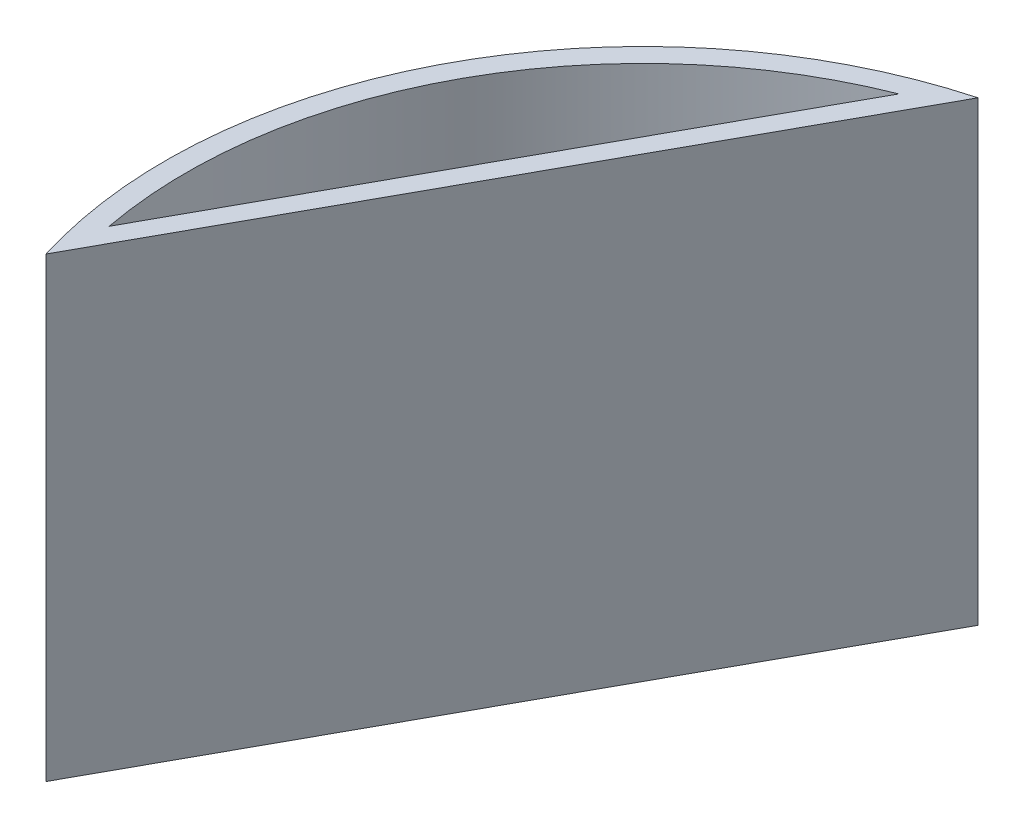
ISO-10303-21;
HEADER;
FILE_DESCRIPTION(('STEP AP214'),'2;1');
FILE_NAME('part.step','',(''),(''),'','','');
FILE_SCHEMA(('AUTOMOTIVE_DESIGN { 1 0 10303 214 1 1 1 1 }'));
ENDSEC;
DATA;
#1=APPLICATION_CONTEXT('core data for automotive mechanical design processes');
#2=APPLICATION_PROTOCOL_DEFINITION('international standard','automotive_design',2000,#1);
#3=PRODUCT_CONTEXT('',#1,'mechanical');
#4=PRODUCT('Part','Part','',(#3));
#5=PRODUCT_RELATED_PRODUCT_CATEGORY('part','',(#4));
#6=PRODUCT_DEFINITION_FORMATION('','',#4);
#7=PRODUCT_DEFINITION_CONTEXT('part definition',#1,'design');
#8=PRODUCT_DEFINITION('design','',#6,#7);
#9=PRODUCT_DEFINITION_SHAPE('','',#8);
#10=(LENGTH_UNIT() NAMED_UNIT(*) SI_UNIT(.MILLI.,.METRE.));
#11=(NAMED_UNIT(*) PLANE_ANGLE_UNIT() SI_UNIT($,.RADIAN.));
#12=(NAMED_UNIT(*) SI_UNIT($,.STERADIAN.) SOLID_ANGLE_UNIT());
#13=UNCERTAINTY_MEASURE_WITH_UNIT(LENGTH_MEASURE(1.E-05),#10,'distance_accuracy_value','');
#14=(GEOMETRIC_REPRESENTATION_CONTEXT(3) GLOBAL_UNCERTAINTY_ASSIGNED_CONTEXT((#13)) GLOBAL_UNIT_ASSIGNED_CONTEXT((#10,
#11,#12)) REPRESENTATION_CONTEXT('',''));
#15=CARTESIAN_POINT('',(0.,0.,0.));
#16=DIRECTION('',(0.,0.,1.));
#17=DIRECTION('',(1.,0.,0.));
#18=AXIS2_PLACEMENT_3D('',#15,#16,#17);
#19=CARTESIAN_POINT('',(0.,63.5,0.));
#20=DIRECTION('',(0.,1.,0.));
#21=DIRECTION('',(0.,0.,1.));
#22=AXIS2_PLACEMENT_3D('',#19,#20,#21);
#23=PLANE('',#22);
#24=DIRECTION('',(0.48190085223737,0.,-0.876225752082702));
#25=VECTOR('',#24,1.);
#26=CARTESIAN_POINT('',(-67.6152931744622,63.5,17.5269686178623));
#27=LINE('',#26,#25);
#28=CARTESIAN_POINT('',(-69.7925987140124,63.5,21.4858974619361));
#29=VERTEX_POINT('',#28);
#30=CARTESIAN_POINT('',(-19.2319376975901,63.5,-70.4470240492529));
#31=VERTEX_POINT('',#30);
#32=EDGE_CURVE('E80',#29,#31,#27,.T.);
#33=ORIENTED_EDGE('',*,*,#32,.T.);
#34=CARTESIAN_POINT('',(0.,63.5,0.));
#35=DIRECTION('',(0.,1.,0.));
#36=DIRECTION('',(0.,0.,1.));
#37=AXIS2_PLACEMENT_3D('',#34,#35,#36);
#38=CIRCLE('',#37,73.025);
#39=EDGE_CURVE('E49',#31,#29,#38,.T.);
#40=ORIENTED_EDGE('',*,*,#39,.T.);
#41=EDGE_LOOP('',(#33,#40));
#42=FACE_BOUND('',#41,.T.);
#43=DIRECTION('',(0.48190085223737,0.,-0.876225752082702));
#44=VECTOR('',#43,1.);
#45=CARTESIAN_POINT('',(-25.7918971595235,63.5,-64.9137931483946));
#46=LINE('',#45,#44);
#47=CARTESIAN_POINT('',(-68.6328829234257,63.5,12.9826762117576));
#48=VERTEX_POINT('',#47);
#49=CARTESIAN_POINT('',(-25.7918971595235,63.5,-64.9137931483946));
#50=VERTEX_POINT('',#49);
#51=EDGE_CURVE('E99',#48,#50,#46,.T.);
#52=ORIENTED_EDGE('',*,*,#51,.F.);
#53=CARTESIAN_POINT('',(0.,63.5,0.));
#54=DIRECTION('',(0.,1.,0.));
#55=DIRECTION('',(0.,0.,1.));
#56=AXIS2_PLACEMENT_3D('',#53,#54,#55);
#57=CIRCLE('',#56,69.85);
#58=EDGE_CURVE('E101',#50,#48,#57,.T.);
#59=ORIENTED_EDGE('',*,*,#58,.F.);
#60=EDGE_LOOP('',(#52,#59));
#61=FACE_BOUND('',#60,.T.);
#62=ADVANCED_FACE('F41',(#42,#61),#23,.T.);
#63=CARTESIAN_POINT('',(0.,63.5,0.));
#64=DIRECTION('',(0.,-1.,0.));
#65=DIRECTION('',(0.,0.,-1.));
#66=AXIS2_PLACEMENT_3D('',#63,#64,#65);
#67=CYLINDRICAL_SURFACE('',#66,73.025);
#68=ORIENTED_EDGE('',*,*,#39,.F.);
#69=DIRECTION('',(0.,-1.,0.));
#70=VECTOR('',#69,1.);
#71=CARTESIAN_POINT('',(-19.2319376975901,63.5,-70.4470240492529));
#72=LINE('',#71,#70);
#73=CARTESIAN_POINT('',(-19.2319376975901,-6.35,-70.4470240492529));
#74=VERTEX_POINT('',#73);
#75=EDGE_CURVE('E87',#31,#74,#72,.T.);
#76=ORIENTED_EDGE('',*,*,#75,.T.);
#77=CARTESIAN_POINT('',(0.,-6.35,0.));
#78=DIRECTION('',(0.,-1.,0.));
#79=DIRECTION('',(0.,0.,-1.));
#80=AXIS2_PLACEMENT_3D('',#77,#78,#79);
#81=CIRCLE('',#80,73.025);
#82=CARTESIAN_POINT('',(-69.7925987140124,-6.35,21.485897461936));
#83=VERTEX_POINT('',#82);
#84=EDGE_CURVE('E84',#83,#74,#81,.T.);
#85=ORIENTED_EDGE('',*,*,#84,.F.);
#86=DIRECTION('',(0.,-1.,0.));
#87=VECTOR('',#86,1.);
#88=CARTESIAN_POINT('',(-69.7925987140124,63.5,21.485897461936));
#89=LINE('',#88,#87);
#90=EDGE_CURVE('E55',#83,#29,#89,.F.);
#91=ORIENTED_EDGE('',*,*,#90,.T.);
#92=EDGE_LOOP('',(#68,#76,#85,#91));
#93=FACE_BOUND('',#92,.T.);
#94=ADVANCED_FACE('F43',(#93),#67,.T.);
#95=CARTESIAN_POINT('',(0.,-6.35,0.));
#96=DIRECTION('',(0.,-1.,0.));
#97=DIRECTION('',(0.,0.,-1.));
#98=AXIS2_PLACEMENT_3D('',#95,#96,#97);
#99=PLANE('',#98);
#100=DIRECTION('',(0.48190085223737,0.,-0.876225752082702));
#101=VECTOR('',#100,1.);
#102=CARTESIAN_POINT('',(-44.5122682058013,-6.35,-24.4805632936584));
#103=LINE('',#102,#101);
#104=EDGE_CURVE('E11',#83,#74,#103,.T.);
#105=ORIENTED_EDGE('',*,*,#104,.F.);
#106=ORIENTED_EDGE('',*,*,#84,.T.);
#107=EDGE_LOOP('',(#105,#106));
#108=FACE_BOUND('',#107,.T.);
#109=ADVANCED_FACE('F121',(#108),#99,.T.);
#110=CARTESIAN_POINT('',(-67.6152931744622,63.5,17.5269686178623));
#111=DIRECTION('',(-0.876225752082702,0.,-0.48190085223737));
#112=DIRECTION('',(-0.48190085223737,0.,0.876225752082702));
#113=AXIS2_PLACEMENT_3D('',#110,#111,#112);
#114=PLANE('',#113);
#115=ORIENTED_EDGE('',*,*,#32,.F.);
#116=ORIENTED_EDGE('',*,*,#90,.F.);
#117=ORIENTED_EDGE('',*,*,#104,.T.);
#118=ORIENTED_EDGE('',*,*,#75,.F.);
#119=EDGE_LOOP('',(#115,#116,#117,#118));
#120=FACE_BOUND('',#119,.T.);
#121=ADVANCED_FACE('F88',(#120),#114,.F.);
#122=CARTESIAN_POINT('',(0.,63.5,0.));
#123=DIRECTION('',(0.,-1.,0.));
#124=DIRECTION('',(0.,0.,-1.));
#125=AXIS2_PLACEMENT_3D('',#122,#123,#124);
#126=CYLINDRICAL_SURFACE('',#125,69.85);
#127=DIRECTION('',(0.,-1.,0.));
#128=VECTOR('',#127,1.);
#129=CARTESIAN_POINT('',(-25.7918971595235,63.5,-64.9137931483946));
#130=LINE('',#129,#128);
#131=CARTESIAN_POINT('',(-25.7918971595235,0.,-64.9137931483946));
#132=VERTEX_POINT('',#131);
#133=EDGE_CURVE('E97',#50,#132,#130,.T.);
#134=ORIENTED_EDGE('',*,*,#133,.F.);
#135=ORIENTED_EDGE('',*,*,#58,.T.);
#136=DIRECTION('',(0.,-1.,0.));
#137=VECTOR('',#136,1.);
#138=CARTESIAN_POINT('',(-68.6328829234257,63.5,12.9826762117576));
#139=LINE('',#138,#137);
#140=CARTESIAN_POINT('',(-68.6328829234257,0.,12.9826762117576));
#141=VERTEX_POINT('',#140);
#142=EDGE_CURVE('E63',#48,#141,#139,.T.);
#143=ORIENTED_EDGE('',*,*,#142,.T.);
#144=CARTESIAN_POINT('',(0.,0.,0.));
#145=DIRECTION('',(0.,1.,0.));
#146=DIRECTION('',(0.,0.,1.));
#147=AXIS2_PLACEMENT_3D('',#144,#145,#146);
#148=CIRCLE('',#147,69.85);
#149=EDGE_CURVE('E92',#132,#141,#148,.T.);
#150=ORIENTED_EDGE('',*,*,#149,.F.);
#151=EDGE_LOOP('',(#134,#135,#143,#150));
#152=FACE_BOUND('',#151,.T.);
#153=ADVANCED_FACE('F116',(#152),#126,.F.);
#154=CARTESIAN_POINT('',(-25.7918971595235,63.5,-64.9137931483946));
#155=DIRECTION('',(-0.876225752082702,0.,-0.48190085223737));
#156=DIRECTION('',(-0.48190085223737,0.,0.876225752082702));
#157=AXIS2_PLACEMENT_3D('',#154,#155,#156);
#158=PLANE('',#157);
#159=ORIENTED_EDGE('',*,*,#142,.F.);
#160=ORIENTED_EDGE('',*,*,#51,.T.);
#161=ORIENTED_EDGE('',*,*,#133,.T.);
#162=DIRECTION('',(0.48190085223737,0.,-0.876225752082702));
#163=VECTOR('',#162,1.);
#164=CARTESIAN_POINT('',(-25.7918971595235,0.,-64.9137931483946));
#165=LINE('',#164,#163);
#166=EDGE_CURVE('E103',#141,#132,#165,.T.);
#167=ORIENTED_EDGE('',*,*,#166,.F.);
#168=EDGE_LOOP('',(#159,#160,#161,#167));
#169=FACE_BOUND('',#168,.T.);
#170=ADVANCED_FACE('F113',(#169),#158,.T.);
#171=CARTESIAN_POINT('',(0.,0.,0.));
#172=DIRECTION('',(0.,1.,0.));
#173=DIRECTION('',(0.,0.,1.));
#174=AXIS2_PLACEMENT_3D('',#171,#172,#173);
#175=PLANE('',#174);
#176=ORIENTED_EDGE('',*,*,#149,.T.);
#177=ORIENTED_EDGE('',*,*,#166,.T.);
#178=EDGE_LOOP('',(#176,#177));
#179=FACE_BOUND('',#178,.T.);
#180=ADVANCED_FACE('F110',(#179),#175,.T.);
#181=CLOSED_SHELL('',(#62,#94,#109,#121,#153,#170,#180));
#182=MANIFOLD_SOLID_BREP('B2',#181);
#183=ADVANCED_BREP_SHAPE_REPRESENTATION('',(#18,#182),#14);
#184=SHAPE_DEFINITION_REPRESENTATION(#9,#183);
ENDSEC;
END-ISO-10303-21;
